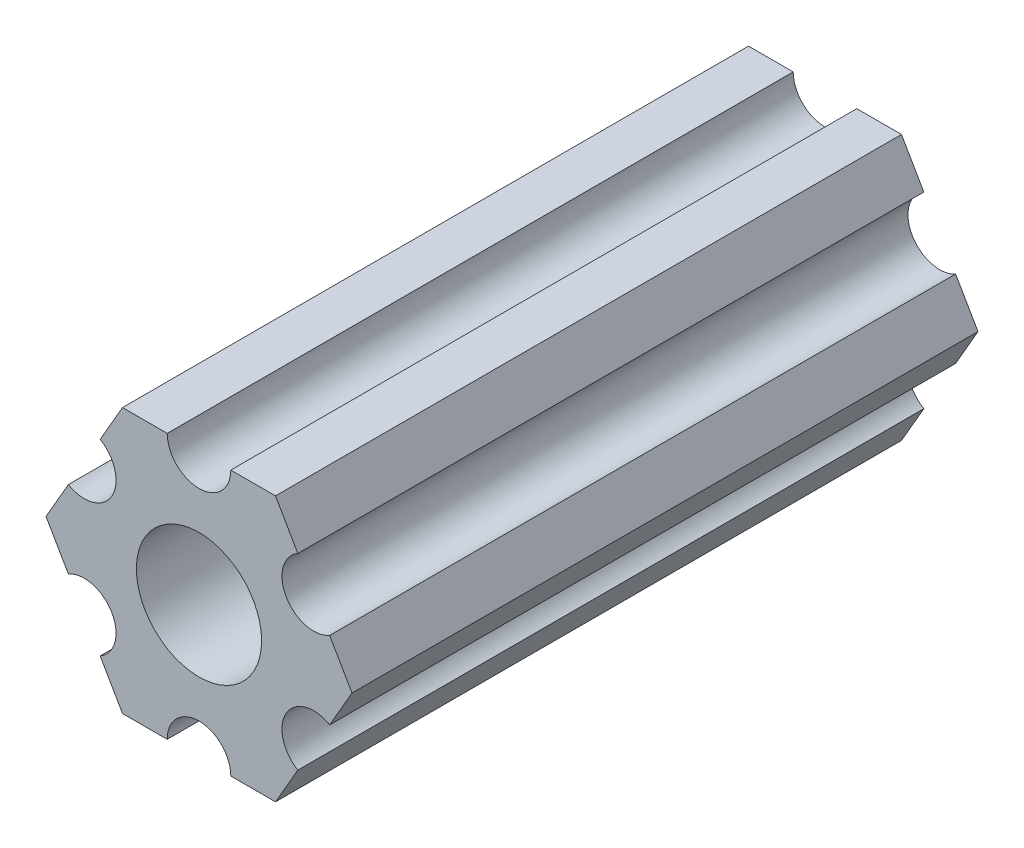
ISO-10303-21;
HEADER;
FILE_DESCRIPTION(('STEP AP214'),'2;1');
FILE_NAME('part.step','',(''),(''),'','','');
FILE_SCHEMA(('AUTOMOTIVE_DESIGN { 1 0 10303 214 1 1 1 1 }'));
ENDSEC;
DATA;
#1=APPLICATION_CONTEXT('core data for automotive mechanical design processes');
#2=APPLICATION_PROTOCOL_DEFINITION('international standard','automotive_design',2000,#1);
#3=PRODUCT_CONTEXT('',#1,'mechanical');
#4=PRODUCT('Part','Part','',(#3));
#5=PRODUCT_RELATED_PRODUCT_CATEGORY('part','',(#4));
#6=PRODUCT_DEFINITION_FORMATION('','',#4);
#7=PRODUCT_DEFINITION_CONTEXT('part definition',#1,'design');
#8=PRODUCT_DEFINITION('design','',#6,#7);
#9=PRODUCT_DEFINITION_SHAPE('','',#8);
#10=(LENGTH_UNIT() NAMED_UNIT(*) SI_UNIT(.MILLI.,.METRE.));
#11=(NAMED_UNIT(*) PLANE_ANGLE_UNIT() SI_UNIT($,.RADIAN.));
#12=(NAMED_UNIT(*) SI_UNIT($,.STERADIAN.) SOLID_ANGLE_UNIT());
#13=UNCERTAINTY_MEASURE_WITH_UNIT(LENGTH_MEASURE(1.E-05),#10,'distance_accuracy_value','');
#14=(GEOMETRIC_REPRESENTATION_CONTEXT(3) GLOBAL_UNCERTAINTY_ASSIGNED_CONTEXT((#13)) GLOBAL_UNIT_ASSIGNED_CONTEXT((#10,
#11,#12)) REPRESENTATION_CONTEXT('',''));
#15=CARTESIAN_POINT('',(0.,0.,0.));
#16=DIRECTION('',(0.,0.,1.));
#17=DIRECTION('',(1.,0.,0.));
#18=AXIS2_PLACEMENT_3D('',#15,#16,#17);
#19=CARTESIAN_POINT('',(-5.49926131403119,3.175,30.));
#20=DIRECTION('',(0.,0.,-1.));
#21=DIRECTION('',(-1.,0.,0.));
#22=AXIS2_PLACEMENT_3D('',#19,#20,#21);
#23=CYLINDRICAL_SURFACE('',#22,1.52400000000008);
#24=CARTESIAN_POINT('',(-5.49926131403119,3.175,0.));
#25=DIRECTION('',(0.,0.,1.));
#26=DIRECTION('',(1.,0.,0.));
#27=AXIS2_PLACEMENT_3D('',#24,#25,#26);
#28=CIRCLE('',#27,1.52400000000008);
#29=CARTESIAN_POINT('',(-6.26126131403123,1.85517728463245,0.));
#30=VERTEX_POINT('',#29);
#31=CARTESIAN_POINT('',(-4.73726131403115,4.49482271536755,0.));
#32=VERTEX_POINT('',#31);
#33=EDGE_CURVE('E197',#30,#32,#28,.T.);
#34=ORIENTED_EDGE('',*,*,#33,.F.);
#35=DIRECTION('',(0.,0.,-1.));
#36=VECTOR('',#35,1.);
#37=CARTESIAN_POINT('',(-6.26126131403123,1.85517728463245,30.));
#38=LINE('',#37,#36);
#39=CARTESIAN_POINT('',(-6.26126131403123,1.85517728463245,30.));
#40=VERTEX_POINT('',#39);
#41=EDGE_CURVE('E11',#40,#30,#38,.T.);
#42=ORIENTED_EDGE('',*,*,#41,.F.);
#43=CARTESIAN_POINT('',(-5.49926131403119,3.175,30.));
#44=DIRECTION('',(0.,0.,1.));
#45=DIRECTION('',(1.,0.,0.));
#46=AXIS2_PLACEMENT_3D('',#43,#44,#45);
#47=CIRCLE('',#46,1.52400000000008);
#48=CARTESIAN_POINT('',(-4.73726131403115,4.49482271536755,30.));
#49=VERTEX_POINT('',#48);
#50=EDGE_CURVE('E238',#40,#49,#47,.T.);
#51=ORIENTED_EDGE('',*,*,#50,.T.);
#52=DIRECTION('',(0.,0.,-1.));
#53=VECTOR('',#52,1.);
#54=CARTESIAN_POINT('',(-4.73726131403115,4.49482271536755,30.));
#55=LINE('',#54,#53);
#56=EDGE_CURVE('E121',#49,#32,#55,.T.);
#57=ORIENTED_EDGE('',*,*,#56,.T.);
#58=EDGE_LOOP('',(#34,#42,#51,#57));
#59=FACE_BOUND('',#58,.T.);
#60=ADVANCED_FACE('F41',(#59),#23,.F.);
#61=CARTESIAN_POINT('',(-5.49926131403118,3.175,30.));
#62=DIRECTION('',(0.866025403784439,-0.5,0.));
#63=DIRECTION('',(0.5,0.866025403784439,0.));
#64=AXIS2_PLACEMENT_3D('',#61,#62,#63);
#65=PLANE('',#64);
#66=DIRECTION('',(-0.5,-0.866025403784439,0.));
#67=VECTOR('',#66,1.);
#68=CARTESIAN_POINT('',(-5.49926131403118,3.175,0.));
#69=LINE('',#68,#67);
#70=CARTESIAN_POINT('',(-7.33234841870825,0.,0.));
#71=VERTEX_POINT('',#70);
#72=EDGE_CURVE('E200',#30,#71,#69,.T.);
#73=ORIENTED_EDGE('',*,*,#72,.T.);
#74=DIRECTION('',(0.,0.,-1.));
#75=VECTOR('',#74,1.);
#76=CARTESIAN_POINT('',(-7.33234841870825,0.,30.));
#77=LINE('',#76,#75);
#78=CARTESIAN_POINT('',(-7.33234841870825,0.,30.));
#79=VERTEX_POINT('',#78);
#80=EDGE_CURVE('E49',#79,#71,#77,.T.);
#81=ORIENTED_EDGE('',*,*,#80,.F.);
#82=DIRECTION('',(-0.5,-0.866025403784439,0.));
#83=VECTOR('',#82,1.);
#84=CARTESIAN_POINT('',(-5.49926131403118,3.175,30.));
#85=LINE('',#84,#83);
#86=EDGE_CURVE('E295',#40,#79,#85,.T.);
#87=ORIENTED_EDGE('',*,*,#86,.F.);
#88=ORIENTED_EDGE('',*,*,#41,.T.);
#89=EDGE_LOOP('',(#73,#81,#87,#88));
#90=FACE_BOUND('',#89,.T.);
#91=ADVANCED_FACE('F326',(#90),#65,.F.);
#92=CARTESIAN_POINT('',(-5.49926131403118,-3.175,30.));
#93=DIRECTION('',(0.866025403784439,0.5,0.));
#94=DIRECTION('',(-0.5,0.866025403784439,0.));
#95=AXIS2_PLACEMENT_3D('',#92,#93,#94);
#96=PLANE('',#95);
#97=DIRECTION('',(0.5,-0.866025403784439,0.));
#98=VECTOR('',#97,1.);
#99=CARTESIAN_POINT('',(-5.49926131403118,-3.175,0.));
#100=LINE('',#99,#98);
#101=CARTESIAN_POINT('',(-6.2612613140314,-1.85517728463214,0.));
#102=VERTEX_POINT('',#101);
#103=EDGE_CURVE('E202',#71,#102,#100,.T.);
#104=ORIENTED_EDGE('',*,*,#103,.T.);
#105=DIRECTION('',(0.,0.,-1.));
#106=VECTOR('',#105,1.);
#107=CARTESIAN_POINT('',(-6.2612613140314,-1.85517728463214,30.));
#108=LINE('',#107,#106);
#109=CARTESIAN_POINT('',(-6.2612613140314,-1.85517728463214,30.));
#110=VERTEX_POINT('',#109);
#111=EDGE_CURVE('E268',#110,#102,#108,.T.);
#112=ORIENTED_EDGE('',*,*,#111,.F.);
#113=DIRECTION('',(0.5,-0.866025403784439,0.));
#114=VECTOR('',#113,1.);
#115=CARTESIAN_POINT('',(-5.49926131403118,-3.175,30.));
#116=LINE('',#115,#114);
#117=EDGE_CURVE('E276',#79,#110,#116,.T.);
#118=ORIENTED_EDGE('',*,*,#117,.F.);
#119=ORIENTED_EDGE('',*,*,#80,.T.);
#120=EDGE_LOOP('',(#104,#112,#118,#119));
#121=FACE_BOUND('',#120,.T.);
#122=ADVANCED_FACE('F274',(#121),#96,.F.);
#123=CARTESIAN_POINT('',(-5.49926131403118,-3.175,30.));
#124=DIRECTION('',(0.,0.,-1.));
#125=DIRECTION('',(-1.,0.,0.));
#126=AXIS2_PLACEMENT_3D('',#123,#124,#125);
#127=CYLINDRICAL_SURFACE('',#126,1.52400000000043);
#128=CARTESIAN_POINT('',(-5.49926131403118,-3.175,0.));
#129=DIRECTION('',(0.,0.,1.));
#130=DIRECTION('',(1.,0.,0.));
#131=AXIS2_PLACEMENT_3D('',#128,#129,#130);
#132=CIRCLE('',#131,1.52400000000043);
#133=CARTESIAN_POINT('',(-4.73726131403097,-4.49482271536785,0.));
#134=VERTEX_POINT('',#133);
#135=EDGE_CURVE('E206',#134,#102,#132,.T.);
#136=ORIENTED_EDGE('',*,*,#135,.F.);
#137=DIRECTION('',(0.,0.,-1.));
#138=VECTOR('',#137,1.);
#139=CARTESIAN_POINT('',(-4.73726131403097,-4.49482271536785,30.));
#140=LINE('',#139,#138);
#141=CARTESIAN_POINT('',(-4.73726131403097,-4.49482271536785,30.));
#142=VERTEX_POINT('',#141);
#143=EDGE_CURVE('E266',#142,#134,#140,.T.);
#144=ORIENTED_EDGE('',*,*,#143,.F.);
#145=CARTESIAN_POINT('',(-5.49926131403118,-3.175,30.));
#146=DIRECTION('',(0.,0.,1.));
#147=DIRECTION('',(1.,0.,0.));
#148=AXIS2_PLACEMENT_3D('',#145,#146,#147);
#149=CIRCLE('',#148,1.52400000000043);
#150=EDGE_CURVE('E290',#142,#110,#149,.T.);
#151=ORIENTED_EDGE('',*,*,#150,.T.);
#152=ORIENTED_EDGE('',*,*,#111,.T.);
#153=EDGE_LOOP('',(#136,#144,#151,#152));
#154=FACE_BOUND('',#153,.T.);
#155=ADVANCED_FACE('F286',(#154),#127,.F.);
#156=CARTESIAN_POINT('',(-3.66617420935412,-6.35,0.));
#157=VERTEX_POINT('',#156);
#158=EDGE_CURVE('E207',#134,#157,#100,.T.);
#159=ORIENTED_EDGE('',*,*,#158,.T.);
#160=DIRECTION('',(0.,0.,-1.));
#161=VECTOR('',#160,1.);
#162=CARTESIAN_POINT('',(-3.66617420935412,-6.35,30.));
#163=LINE('',#162,#161);
#164=CARTESIAN_POINT('',(-3.66617420935412,-6.35,30.));
#165=VERTEX_POINT('',#164);
#166=EDGE_CURVE('E263',#165,#157,#163,.T.);
#167=ORIENTED_EDGE('',*,*,#166,.F.);
#168=EDGE_CURVE('E291',#142,#165,#116,.T.);
#169=ORIENTED_EDGE('',*,*,#168,.F.);
#170=ORIENTED_EDGE('',*,*,#143,.T.);
#171=EDGE_LOOP('',(#159,#167,#169,#170));
#172=FACE_BOUND('',#171,.T.);
#173=ADVANCED_FACE('F335',(#172),#96,.F.);
#174=CARTESIAN_POINT('',(0.,-6.35,30.));
#175=DIRECTION('',(0.,1.,0.));
#176=DIRECTION('',(0.,0.,1.));
#177=AXIS2_PLACEMENT_3D('',#174,#175,#176);
#178=PLANE('',#177);
#179=DIRECTION('',(1.,0.,0.));
#180=VECTOR('',#179,1.);
#181=CARTESIAN_POINT('',(0.,-6.35,0.));
#182=LINE('',#181,#180);
#183=CARTESIAN_POINT('',(-1.5240000000007,-6.35,0.));
#184=VERTEX_POINT('',#183);
#185=EDGE_CURVE('E210',#157,#184,#182,.T.);
#186=ORIENTED_EDGE('',*,*,#185,.T.);
#187=DIRECTION('',(0.,0.,-1.));
#188=VECTOR('',#187,1.);
#189=CARTESIAN_POINT('',(-1.5240000000007,-6.35,30.));
#190=LINE('',#189,#188);
#191=CARTESIAN_POINT('',(-1.5240000000007,-6.35,30.));
#192=VERTEX_POINT('',#191);
#193=EDGE_CURVE('E261',#192,#184,#190,.T.);
#194=ORIENTED_EDGE('',*,*,#193,.F.);
#195=DIRECTION('',(1.,0.,0.));
#196=VECTOR('',#195,1.);
#197=CARTESIAN_POINT('',(0.,-6.35,30.));
#198=LINE('',#197,#196);
#199=EDGE_CURVE('E293',#165,#192,#198,.T.);
#200=ORIENTED_EDGE('',*,*,#199,.F.);
#201=ORIENTED_EDGE('',*,*,#166,.T.);
#202=EDGE_LOOP('',(#186,#194,#200,#201));
#203=FACE_BOUND('',#202,.T.);
#204=ADVANCED_FACE('F395',(#203),#178,.F.);
#205=CARTESIAN_POINT('',(0.,-6.34999999999999,30.));
#206=DIRECTION('',(0.,0.,-1.));
#207=DIRECTION('',(-1.,0.,0.));
#208=AXIS2_PLACEMENT_3D('',#205,#206,#207);
#209=CYLINDRICAL_SURFACE('',#208,1.52400000000069);
#210=CARTESIAN_POINT('',(0.,-6.34999999999999,0.));
#211=DIRECTION('',(0.,0.,1.));
#212=DIRECTION('',(1.,0.,0.));
#213=AXIS2_PLACEMENT_3D('',#210,#211,#212);
#214=CIRCLE('',#213,1.52400000000069);
#215=CARTESIAN_POINT('',(1.52400000000069,-6.35,0.));
#216=VERTEX_POINT('',#215);
#217=EDGE_CURVE('E213',#216,#184,#214,.T.);
#218=ORIENTED_EDGE('',*,*,#217,.F.);
#219=DIRECTION('',(0.,0.,-1.));
#220=VECTOR('',#219,1.);
#221=CARTESIAN_POINT('',(1.52400000000069,-6.35,30.));
#222=LINE('',#221,#220);
#223=CARTESIAN_POINT('',(1.52400000000069,-6.35,30.));
#224=VERTEX_POINT('',#223);
#225=EDGE_CURVE('E259',#224,#216,#222,.T.);
#226=ORIENTED_EDGE('',*,*,#225,.F.);
#227=CARTESIAN_POINT('',(0.,-6.34999999999999,30.));
#228=DIRECTION('',(0.,0.,1.));
#229=DIRECTION('',(1.,0.,0.));
#230=AXIS2_PLACEMENT_3D('',#227,#228,#229);
#231=CIRCLE('',#230,1.52400000000069);
#232=EDGE_CURVE('E299',#224,#192,#231,.T.);
#233=ORIENTED_EDGE('',*,*,#232,.T.);
#234=ORIENTED_EDGE('',*,*,#193,.T.);
#235=EDGE_LOOP('',(#218,#226,#233,#234));
#236=FACE_BOUND('',#235,.T.);
#237=ADVANCED_FACE('F389',(#236),#209,.F.);
#238=CARTESIAN_POINT('',(3.66617420935412,-6.35,0.));
#239=VERTEX_POINT('',#238);
#240=EDGE_CURVE('E214',#216,#239,#182,.T.);
#241=ORIENTED_EDGE('',*,*,#240,.T.);
#242=DIRECTION('',(0.,0.,-1.));
#243=VECTOR('',#242,1.);
#244=CARTESIAN_POINT('',(3.66617420935412,-6.35,30.));
#245=LINE('',#244,#243);
#246=CARTESIAN_POINT('',(3.66617420935412,-6.35,30.));
#247=VERTEX_POINT('',#246);
#248=EDGE_CURVE('E256',#247,#239,#245,.T.);
#249=ORIENTED_EDGE('',*,*,#248,.F.);
#250=EDGE_CURVE('E300',#224,#247,#198,.T.);
#251=ORIENTED_EDGE('',*,*,#250,.F.);
#252=ORIENTED_EDGE('',*,*,#225,.T.);
#253=EDGE_LOOP('',(#241,#249,#251,#252));
#254=FACE_BOUND('',#253,.T.);
#255=ADVANCED_FACE('F398',(#254),#178,.F.);
#256=CARTESIAN_POINT('',(5.49926131403118,-3.175,30.));
#257=DIRECTION('',(-0.866025403784439,0.5,0.));
#258=DIRECTION('',(-0.5,-0.866025403784439,0.));
#259=AXIS2_PLACEMENT_3D('',#256,#257,#258);
#260=PLANE('',#259);
#261=DIRECTION('',(0.5,0.866025403784439,0.));
#262=VECTOR('',#261,1.);
#263=CARTESIAN_POINT('',(5.49926131403118,-3.175,0.));
#264=LINE('',#263,#262);
#265=CARTESIAN_POINT('',(4.73726131403088,-4.49482271536802,0.));
#266=VERTEX_POINT('',#265);
#267=EDGE_CURVE('E217',#239,#266,#264,.T.);
#268=ORIENTED_EDGE('',*,*,#267,.T.);
#269=DIRECTION('',(0.,0.,-1.));
#270=VECTOR('',#269,1.);
#271=CARTESIAN_POINT('',(4.73726131403088,-4.49482271536802,30.));
#272=LINE('',#271,#270);
#273=CARTESIAN_POINT('',(4.73726131403088,-4.49482271536802,30.));
#274=VERTEX_POINT('',#273);
#275=EDGE_CURVE('E254',#274,#266,#272,.T.);
#276=ORIENTED_EDGE('',*,*,#275,.F.);
#277=DIRECTION('',(0.5,0.866025403784439,0.));
#278=VECTOR('',#277,1.);
#279=CARTESIAN_POINT('',(5.49926131403118,-3.175,30.));
#280=LINE('',#279,#278);
#281=EDGE_CURVE('E303',#247,#274,#280,.T.);
#282=ORIENTED_EDGE('',*,*,#281,.F.);
#283=ORIENTED_EDGE('',*,*,#248,.T.);
#284=EDGE_LOOP('',(#268,#276,#282,#283));
#285=FACE_BOUND('',#284,.T.);
#286=ADVANCED_FACE('F369',(#285),#260,.F.);
#287=CARTESIAN_POINT('',(5.49926131403118,-3.17499999999999,30.));
#288=DIRECTION('',(0.,0.,-1.));
#289=DIRECTION('',(-1.,0.,0.));
#290=AXIS2_PLACEMENT_3D('',#287,#288,#289);
#291=CYLINDRICAL_SURFACE('',#290,1.52400000000062);
#292=CARTESIAN_POINT('',(5.49926131403118,-3.17499999999999,0.));
#293=DIRECTION('',(0.,0.,1.));
#294=DIRECTION('',(1.,0.,0.));
#295=AXIS2_PLACEMENT_3D('',#292,#293,#294);
#296=CIRCLE('',#295,1.52400000000062);
#297=CARTESIAN_POINT('',(6.26126131403149,-1.85517728463198,0.));
#298=VERTEX_POINT('',#297);
#299=EDGE_CURVE('E220',#298,#266,#296,.T.);
#300=ORIENTED_EDGE('',*,*,#299,.F.);
#301=DIRECTION('',(0.,0.,-1.));
#302=VECTOR('',#301,1.);
#303=CARTESIAN_POINT('',(6.26126131403149,-1.85517728463198,30.));
#304=LINE('',#303,#302);
#305=CARTESIAN_POINT('',(6.26126131403149,-1.85517728463198,30.));
#306=VERTEX_POINT('',#305);
#307=EDGE_CURVE('E252',#306,#298,#304,.T.);
#308=ORIENTED_EDGE('',*,*,#307,.F.);
#309=CARTESIAN_POINT('',(5.49926131403118,-3.17499999999999,30.));
#310=DIRECTION('',(0.,0.,1.));
#311=DIRECTION('',(1.,0.,0.));
#312=AXIS2_PLACEMENT_3D('',#309,#310,#311);
#313=CIRCLE('',#312,1.52400000000062);
#314=EDGE_CURVE('E305',#306,#274,#313,.T.);
#315=ORIENTED_EDGE('',*,*,#314,.T.);
#316=ORIENTED_EDGE('',*,*,#275,.T.);
#317=EDGE_LOOP('',(#300,#308,#315,#316));
#318=FACE_BOUND('',#317,.T.);
#319=ADVANCED_FACE('F366',(#318),#291,.F.);
#320=CARTESIAN_POINT('',(7.33234841870825,0.,0.));
#321=VERTEX_POINT('',#320);
#322=EDGE_CURVE('E221',#298,#321,#264,.T.);
#323=ORIENTED_EDGE('',*,*,#322,.T.);
#324=DIRECTION('',(0.,0.,-1.));
#325=VECTOR('',#324,1.);
#326=CARTESIAN_POINT('',(7.33234841870825,0.,30.));
#327=LINE('',#326,#325);
#328=CARTESIAN_POINT('',(7.33234841870825,0.,30.));
#329=VERTEX_POINT('',#328);
#330=EDGE_CURVE('E249',#329,#321,#327,.T.);
#331=ORIENTED_EDGE('',*,*,#330,.F.);
#332=EDGE_CURVE('E306',#306,#329,#280,.T.);
#333=ORIENTED_EDGE('',*,*,#332,.F.);
#334=ORIENTED_EDGE('',*,*,#307,.T.);
#335=EDGE_LOOP('',(#323,#331,#333,#334));
#336=FACE_BOUND('',#335,.T.);
#337=ADVANCED_FACE('F361',(#336),#260,.F.);
#338=CARTESIAN_POINT('',(5.49926131403118,3.175,30.));
#339=DIRECTION('',(-0.866025403784439,-0.5,0.));
#340=DIRECTION('',(0.5,-0.866025403784439,0.));
#341=AXIS2_PLACEMENT_3D('',#338,#339,#340);
#342=PLANE('',#341);
#343=DIRECTION('',(-0.5,0.866025403784439,0.));
#344=VECTOR('',#343,1.);
#345=CARTESIAN_POINT('',(5.49926131403118,3.175,0.));
#346=LINE('',#345,#344);
#347=CARTESIAN_POINT('',(6.26126131403132,1.85517728463229,0.));
#348=VERTEX_POINT('',#347);
#349=EDGE_CURVE('E224',#321,#348,#346,.T.);
#350=ORIENTED_EDGE('',*,*,#349,.T.);
#351=DIRECTION('',(0.,0.,-1.));
#352=VECTOR('',#351,1.);
#353=CARTESIAN_POINT('',(6.26126131403132,1.85517728463229,30.));
#354=LINE('',#353,#352);
#355=CARTESIAN_POINT('',(6.26126131403132,1.85517728463229,30.));
#356=VERTEX_POINT('',#355);
#357=EDGE_CURVE('E247',#356,#348,#354,.T.);
#358=ORIENTED_EDGE('',*,*,#357,.F.);
#359=DIRECTION('',(-0.5,0.866025403784439,0.));
#360=VECTOR('',#359,1.);
#361=CARTESIAN_POINT('',(5.49926131403118,3.175,30.));
#362=LINE('',#361,#360);
#363=EDGE_CURVE('E309',#329,#356,#362,.T.);
#364=ORIENTED_EDGE('',*,*,#363,.F.);
#365=ORIENTED_EDGE('',*,*,#330,.T.);
#366=EDGE_LOOP('',(#350,#358,#364,#365));
#367=FACE_BOUND('',#366,.T.);
#368=ADVANCED_FACE('F355',(#367),#342,.F.);
#369=CARTESIAN_POINT('',(5.49926131403118,3.175,30.));
#370=DIRECTION('',(0.,0.,-1.));
#371=DIRECTION('',(-1.,0.,0.));
#372=AXIS2_PLACEMENT_3D('',#369,#370,#371);
#373=CYLINDRICAL_SURFACE('',#372,1.52400000000027);
#374=CARTESIAN_POINT('',(5.49926131403118,3.175,0.));
#375=DIRECTION('',(0.,0.,1.));
#376=DIRECTION('',(1.,0.,0.));
#377=AXIS2_PLACEMENT_3D('',#374,#375,#376);
#378=CIRCLE('',#377,1.52400000000027);
#379=CARTESIAN_POINT('',(4.73726131403105,4.49482271536772,0.));
#380=VERTEX_POINT('',#379);
#381=EDGE_CURVE('E227',#380,#348,#378,.T.);
#382=ORIENTED_EDGE('',*,*,#381,.F.);
#383=DIRECTION('',(0.,0.,-1.));
#384=VECTOR('',#383,1.);
#385=CARTESIAN_POINT('',(4.73726131403105,4.49482271536772,30.));
#386=LINE('',#385,#384);
#387=CARTESIAN_POINT('',(4.73726131403105,4.49482271536772,30.));
#388=VERTEX_POINT('',#387);
#389=EDGE_CURVE('E245',#388,#380,#386,.T.);
#390=ORIENTED_EDGE('',*,*,#389,.F.);
#391=CARTESIAN_POINT('',(5.49926131403118,3.175,30.));
#392=DIRECTION('',(0.,0.,1.));
#393=DIRECTION('',(1.,0.,0.));
#394=AXIS2_PLACEMENT_3D('',#391,#392,#393);
#395=CIRCLE('',#394,1.52400000000027);
#396=EDGE_CURVE('E310',#388,#356,#395,.T.);
#397=ORIENTED_EDGE('',*,*,#396,.T.);
#398=ORIENTED_EDGE('',*,*,#357,.T.);
#399=EDGE_LOOP('',(#382,#390,#397,#398));
#400=FACE_BOUND('',#399,.T.);
#401=ADVANCED_FACE('F353',(#400),#373,.F.);
#402=CARTESIAN_POINT('',(3.66617420935413,6.35,0.));
#403=VERTEX_POINT('',#402);
#404=EDGE_CURVE('E228',#380,#403,#346,.T.);
#405=ORIENTED_EDGE('',*,*,#404,.T.);
#406=DIRECTION('',(0.,0.,-1.));
#407=VECTOR('',#406,1.);
#408=CARTESIAN_POINT('',(3.66617420935413,6.35,30.));
#409=LINE('',#408,#407);
#410=CARTESIAN_POINT('',(3.66617420935413,6.35,30.));
#411=VERTEX_POINT('',#410);
#412=EDGE_CURVE('E242',#411,#403,#409,.T.);
#413=ORIENTED_EDGE('',*,*,#412,.F.);
#414=EDGE_CURVE('E191',#388,#411,#362,.T.);
#415=ORIENTED_EDGE('',*,*,#414,.F.);
#416=ORIENTED_EDGE('',*,*,#389,.T.);
#417=EDGE_LOOP('',(#405,#413,#415,#416));
#418=FACE_BOUND('',#417,.T.);
#419=ADVANCED_FACE('F317',(#418),#342,.F.);
#420=CARTESIAN_POINT('',(0.,6.35,30.));
#421=DIRECTION('',(0.,-1.,0.));
#422=DIRECTION('',(1.,0.,0.));
#423=AXIS2_PLACEMENT_3D('',#420,#421,#422);
#424=PLANE('',#423);
#425=DIRECTION('',(-1.,0.,0.));
#426=VECTOR('',#425,1.);
#427=CARTESIAN_POINT('',(0.,6.35,0.));
#428=LINE('',#427,#426);
#429=CARTESIAN_POINT('',(1.524,6.35,0.));
#430=VERTEX_POINT('',#429);
#431=EDGE_CURVE('E231',#403,#430,#428,.T.);
#432=ORIENTED_EDGE('',*,*,#431,.T.);
#433=DIRECTION('',(0.,0.,-1.));
#434=VECTOR('',#433,1.);
#435=CARTESIAN_POINT('',(1.524,6.35,30.));
#436=LINE('',#435,#434);
#437=CARTESIAN_POINT('',(1.524,6.35,30.));
#438=VERTEX_POINT('',#437);
#439=EDGE_CURVE('E179',#438,#430,#436,.T.);
#440=ORIENTED_EDGE('',*,*,#439,.F.);
#441=DIRECTION('',(-1.,0.,0.));
#442=VECTOR('',#441,1.);
#443=CARTESIAN_POINT('',(0.,6.35,30.));
#444=LINE('',#443,#442);
#445=EDGE_CURVE('E185',#411,#438,#444,.T.);
#446=ORIENTED_EDGE('',*,*,#445,.F.);
#447=ORIENTED_EDGE('',*,*,#412,.T.);
#448=EDGE_LOOP('',(#432,#440,#446,#447));
#449=FACE_BOUND('',#448,.T.);
#450=ADVANCED_FACE('F321',(#449),#424,.F.);
#451=CARTESIAN_POINT('',(0.,6.35,30.));
#452=DIRECTION('',(0.,0.,-1.));
#453=DIRECTION('',(-1.,0.,0.));
#454=AXIS2_PLACEMENT_3D('',#451,#452,#453);
#455=CYLINDRICAL_SURFACE('',#454,1.524);
#456=CARTESIAN_POINT('',(0.,6.35,0.));
#457=DIRECTION('',(0.,0.,1.));
#458=DIRECTION('',(1.,0.,0.));
#459=AXIS2_PLACEMENT_3D('',#456,#457,#458);
#460=CIRCLE('',#459,1.524);
#461=CARTESIAN_POINT('',(-1.524,6.35,0.));
#462=VERTEX_POINT('',#461);
#463=EDGE_CURVE('E178',#462,#430,#460,.T.);
#464=ORIENTED_EDGE('',*,*,#463,.F.);
#465=DIRECTION('',(0.,0.,-1.));
#466=VECTOR('',#465,1.);
#467=CARTESIAN_POINT('',(-1.524,6.35,30.));
#468=LINE('',#467,#466);
#469=CARTESIAN_POINT('',(-1.524,6.35,30.));
#470=VERTEX_POINT('',#469);
#471=EDGE_CURVE('E172',#470,#462,#468,.T.);
#472=ORIENTED_EDGE('',*,*,#471,.F.);
#473=CARTESIAN_POINT('',(0.,6.35,30.));
#474=DIRECTION('',(0.,0.,1.));
#475=DIRECTION('',(1.,0.,0.));
#476=AXIS2_PLACEMENT_3D('',#473,#474,#475);
#477=CIRCLE('',#476,1.524);
#478=EDGE_CURVE('E176',#470,#438,#477,.T.);
#479=ORIENTED_EDGE('',*,*,#478,.T.);
#480=ORIENTED_EDGE('',*,*,#439,.T.);
#481=EDGE_LOOP('',(#464,#472,#479,#480));
#482=FACE_BOUND('',#481,.T.);
#483=ADVANCED_FACE('F174',(#482),#455,.F.);
#484=CARTESIAN_POINT('',(-3.66617420935412,6.35,0.));
#485=VERTEX_POINT('',#484);
#486=EDGE_CURVE('E114',#462,#485,#428,.T.);
#487=ORIENTED_EDGE('',*,*,#486,.T.);
#488=DIRECTION('',(0.,0.,-1.));
#489=VECTOR('',#488,1.);
#490=CARTESIAN_POINT('',(-3.66617420935412,6.35,30.));
#491=LINE('',#490,#489);
#492=CARTESIAN_POINT('',(-3.66617420935412,6.35,30.));
#493=VERTEX_POINT('',#492);
#494=EDGE_CURVE('E180',#493,#485,#491,.T.);
#495=ORIENTED_EDGE('',*,*,#494,.F.);
#496=EDGE_CURVE('E182',#470,#493,#444,.T.);
#497=ORIENTED_EDGE('',*,*,#496,.F.);
#498=ORIENTED_EDGE('',*,*,#471,.T.);
#499=EDGE_LOOP('',(#487,#495,#497,#498));
#500=FACE_BOUND('',#499,.T.);
#501=ADVANCED_FACE('F183',(#500),#424,.F.);
#502=EDGE_CURVE('E203',#485,#32,#69,.T.);
#503=ORIENTED_EDGE('',*,*,#502,.T.);
#504=ORIENTED_EDGE('',*,*,#56,.F.);
#505=EDGE_CURVE('E57',#493,#49,#85,.T.);
#506=ORIENTED_EDGE('',*,*,#505,.F.);
#507=ORIENTED_EDGE('',*,*,#494,.T.);
#508=EDGE_LOOP('',(#503,#504,#506,#507));
#509=FACE_BOUND('',#508,.T.);
#510=ADVANCED_FACE('F324',(#509),#65,.F.);
#511=CARTESIAN_POINT('',(0.,0.,30.));
#512=DIRECTION('',(0.,0.,-1.));
#513=DIRECTION('',(-1.,0.,0.));
#514=AXIS2_PLACEMENT_3D('',#511,#512,#513);
#515=CYLINDRICAL_SURFACE('',#514,3.);
#516=CARTESIAN_POINT('',(0.,0.,30.));
#517=DIRECTION('',(0.,0.,1.));
#518=DIRECTION('',(1.,0.,0.));
#519=AXIS2_PLACEMENT_3D('',#516,#517,#518);
#520=CIRCLE('',#519,3.);
#521=CARTESIAN_POINT('',(3.,0.,30.));
#522=VERTEX_POINT('',#521);
#523=EDGE_CURVE('E194',#522,#522,#520,.T.);
#524=ORIENTED_EDGE('',*,*,#523,.T.);
#525=EDGE_LOOP('',(#524));
#526=FACE_BOUND('',#525,.T.);
#527=CARTESIAN_POINT('',(0.,0.,0.));
#528=DIRECTION('',(0.,0.,1.));
#529=DIRECTION('',(1.,0.,0.));
#530=AXIS2_PLACEMENT_3D('',#527,#528,#529);
#531=CIRCLE('',#530,3.);
#532=CARTESIAN_POINT('',(3.,0.,0.));
#533=VERTEX_POINT('',#532);
#534=EDGE_CURVE('E235',#533,#533,#531,.T.);
#535=ORIENTED_EDGE('',*,*,#534,.F.);
#536=EDGE_LOOP('',(#535));
#537=FACE_BOUND('',#536,.T.);
#538=ADVANCED_FACE('F339',(#526,#537),#515,.F.);
#539=CARTESIAN_POINT('',(0.,0.,30.));
#540=DIRECTION('',(0.,0.,1.));
#541=DIRECTION('',(1.,0.,0.));
#542=AXIS2_PLACEMENT_3D('',#539,#540,#541);
#543=PLANE('',#542);
#544=ORIENTED_EDGE('',*,*,#50,.F.);
#545=ORIENTED_EDGE('',*,*,#86,.T.);
#546=ORIENTED_EDGE('',*,*,#117,.T.);
#547=ORIENTED_EDGE('',*,*,#150,.F.);
#548=ORIENTED_EDGE('',*,*,#168,.T.);
#549=ORIENTED_EDGE('',*,*,#199,.T.);
#550=ORIENTED_EDGE('',*,*,#232,.F.);
#551=ORIENTED_EDGE('',*,*,#250,.T.);
#552=ORIENTED_EDGE('',*,*,#281,.T.);
#553=ORIENTED_EDGE('',*,*,#314,.F.);
#554=ORIENTED_EDGE('',*,*,#332,.T.);
#555=ORIENTED_EDGE('',*,*,#363,.T.);
#556=ORIENTED_EDGE('',*,*,#396,.F.);
#557=ORIENTED_EDGE('',*,*,#414,.T.);
#558=ORIENTED_EDGE('',*,*,#445,.T.);
#559=ORIENTED_EDGE('',*,*,#478,.F.);
#560=ORIENTED_EDGE('',*,*,#496,.T.);
#561=ORIENTED_EDGE('',*,*,#505,.T.);
#562=EDGE_LOOP('',(#544,#545,#546,#547,#548,#549,#550,#551,#552,#553,#554,#555,#556,#557,#558,
#559,#560,#561));
#563=FACE_BOUND('',#562,.T.);
#564=ORIENTED_EDGE('',*,*,#523,.F.);
#565=EDGE_LOOP('',(#564));
#566=FACE_BOUND('',#565,.T.);
#567=ADVANCED_FACE('F186',(#563,#566),#543,.T.);
#568=CARTESIAN_POINT('',(0.,0.,0.));
#569=DIRECTION('',(0.,0.,1.));
#570=DIRECTION('',(1.,0.,0.));
#571=AXIS2_PLACEMENT_3D('',#568,#569,#570);
#572=PLANE('',#571);
#573=ORIENTED_EDGE('',*,*,#33,.T.);
#574=ORIENTED_EDGE('',*,*,#502,.F.);
#575=ORIENTED_EDGE('',*,*,#486,.F.);
#576=ORIENTED_EDGE('',*,*,#463,.T.);
#577=ORIENTED_EDGE('',*,*,#431,.F.);
#578=ORIENTED_EDGE('',*,*,#404,.F.);
#579=ORIENTED_EDGE('',*,*,#381,.T.);
#580=ORIENTED_EDGE('',*,*,#349,.F.);
#581=ORIENTED_EDGE('',*,*,#322,.F.);
#582=ORIENTED_EDGE('',*,*,#299,.T.);
#583=ORIENTED_EDGE('',*,*,#267,.F.);
#584=ORIENTED_EDGE('',*,*,#240,.F.);
#585=ORIENTED_EDGE('',*,*,#217,.T.);
#586=ORIENTED_EDGE('',*,*,#185,.F.);
#587=ORIENTED_EDGE('',*,*,#158,.F.);
#588=ORIENTED_EDGE('',*,*,#135,.T.);
#589=ORIENTED_EDGE('',*,*,#103,.F.);
#590=ORIENTED_EDGE('',*,*,#72,.F.);
#591=EDGE_LOOP('',(#573,#574,#575,#576,#577,#578,#579,#580,#581,#582,#583,#584,#585,#586,#587,
#588,#589,#590));
#592=FACE_BOUND('',#591,.T.);
#593=ORIENTED_EDGE('',*,*,#534,.T.);
#594=EDGE_LOOP('',(#593));
#595=FACE_BOUND('',#594,.T.);
#596=ADVANCED_FACE('F280',(#592,#595),#572,.F.);
#597=CLOSED_SHELL('',(#60,#91,#122,#155,#173,#204,#237,#255,#286,#319,#337,#368,#401,#419,#450,
#483,#501,#510,#538,#567,#596));
#598=MANIFOLD_SOLID_BREP('B2',#597);
#599=ADVANCED_BREP_SHAPE_REPRESENTATION('',(#18,#598),#14);
#600=SHAPE_DEFINITION_REPRESENTATION(#9,#599);
ENDSEC;
END-ISO-10303-21;
